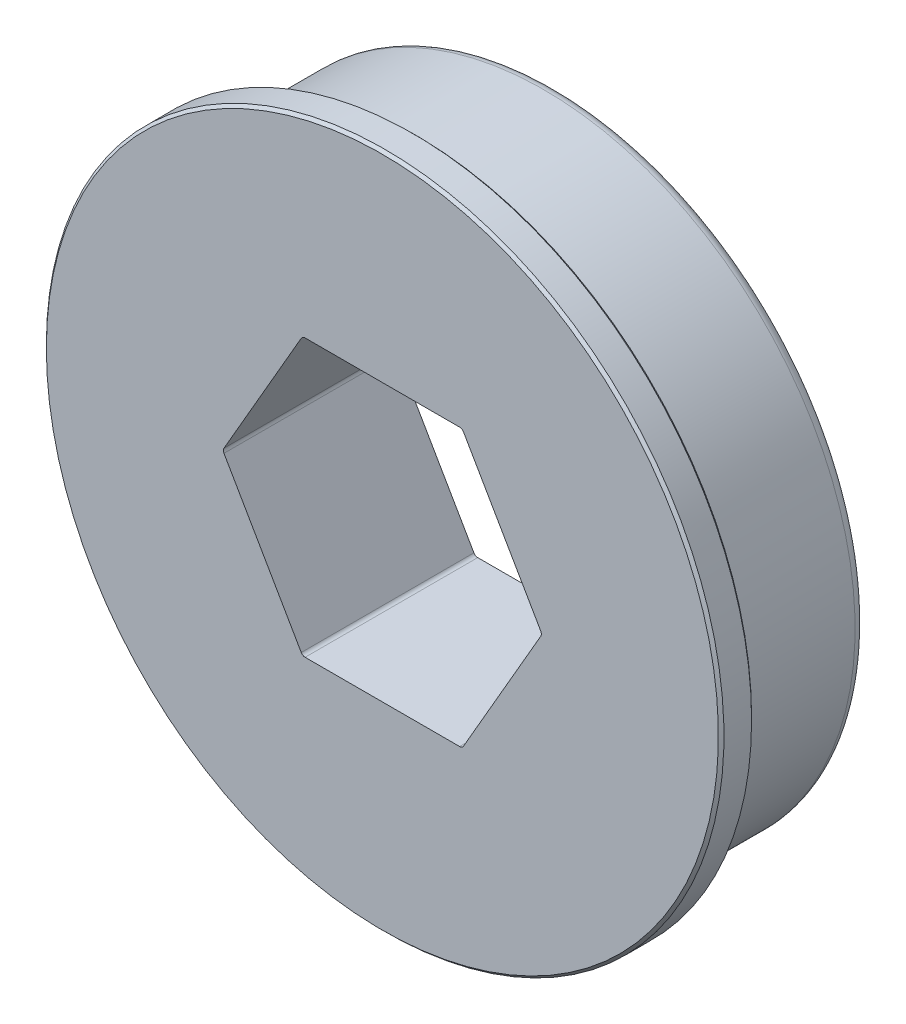
ISO-10303-21;
HEADER;
FILE_DESCRIPTION(('STEP AP214'),'2;1');
FILE_NAME('part.step','',(''),(''),'','','');
FILE_SCHEMA(('AUTOMOTIVE_DESIGN { 1 0 10303 214 1 1 1 1 }'));
ENDSEC;
DATA;
#1=APPLICATION_CONTEXT('core data for automotive mechanical design processes');
#2=APPLICATION_PROTOCOL_DEFINITION('international standard','automotive_design',2000,#1);
#3=PRODUCT_CONTEXT('',#1,'mechanical');
#4=PRODUCT('Part','Part','',(#3));
#5=PRODUCT_RELATED_PRODUCT_CATEGORY('part','',(#4));
#6=PRODUCT_DEFINITION_FORMATION('','',#4);
#7=PRODUCT_DEFINITION_CONTEXT('part definition',#1,'design');
#8=PRODUCT_DEFINITION('design','',#6,#7);
#9=PRODUCT_DEFINITION_SHAPE('','',#8);
#10=(LENGTH_UNIT() NAMED_UNIT(*) SI_UNIT(.MILLI.,.METRE.));
#11=(NAMED_UNIT(*) PLANE_ANGLE_UNIT() SI_UNIT($,.RADIAN.));
#12=(NAMED_UNIT(*) SI_UNIT($,.STERADIAN.) SOLID_ANGLE_UNIT());
#13=UNCERTAINTY_MEASURE_WITH_UNIT(LENGTH_MEASURE(1.E-05),#10,'distance_accuracy_value','');
#14=(GEOMETRIC_REPRESENTATION_CONTEXT(3) GLOBAL_UNCERTAINTY_ASSIGNED_CONTEXT((#13)) GLOBAL_UNIT_ASSIGNED_CONTEXT((#10,
#11,#12)) REPRESENTATION_CONTEXT('',''));
#15=CARTESIAN_POINT('',(0.,0.,0.));
#16=DIRECTION('',(0.,0.,1.));
#17=DIRECTION('',(1.,0.,0.));
#18=AXIS2_PLACEMENT_3D('',#15,#16,#17);
#19=CARTESIAN_POINT('',(0.,0.,7.92734));
#20=DIRECTION('',(0.,0.,-1.));
#21=DIRECTION('',(-1.,0.,0.));
#22=AXIS2_PLACEMENT_3D('',#19,#20,#21);
#23=CYLINDRICAL_SURFACE('',#22,13.97);
#24=CARTESIAN_POINT('',(0.,0.,6.40333999999999));
#25=DIRECTION('',(0.,0.,-1.));
#26=DIRECTION('',(-1.,0.,0.));
#27=AXIS2_PLACEMENT_3D('',#24,#25,#26);
#28=CIRCLE('',#27,13.97);
#29=CARTESIAN_POINT('',(-13.97,0.,6.40333999999999));
#30=VERTEX_POINT('',#29);
#31=EDGE_CURVE('E255',#30,#30,#28,.F.);
#32=ORIENTED_EDGE('',*,*,#31,.F.);
#33=EDGE_LOOP('',(#32));
#34=FACE_BOUND('',#33,.T.);
#35=CARTESIAN_POINT('',(0.,0.,5.89534));
#36=DIRECTION('',(0.,0.,-1.));
#37=DIRECTION('',(-1.,0.,0.));
#38=AXIS2_PLACEMENT_3D('',#35,#36,#37);
#39=CIRCLE('',#38,13.97);
#40=CARTESIAN_POINT('',(-13.97,0.,5.89534));
#41=VERTEX_POINT('',#40);
#42=EDGE_CURVE('E258',#41,#41,#39,.T.);
#43=ORIENTED_EDGE('',*,*,#42,.F.);
#44=EDGE_LOOP('',(#43));
#45=FACE_BOUND('',#44,.T.);
#46=ADVANCED_FACE('F17',(#34,#45),#23,.T.);
#47=CARTESIAN_POINT('',(14.2875,0.,5.89534));
#48=DIRECTION('',(0.,0.,1.));
#49=DIRECTION('',(1.,0.,0.));
#50=AXIS2_PLACEMENT_3D('',#47,#48,#49);
#51=PLANE('',#50);
#52=CARTESIAN_POINT('',(0.,0.,5.89534));
#53=DIRECTION('',(0.,0.,-1.));
#54=DIRECTION('',(-1.,0.,0.));
#55=AXIS2_PLACEMENT_3D('',#52,#53,#54);
#56=CIRCLE('',#55,14.2875);
#57=CARTESIAN_POINT('',(-14.2875,0.,5.89534));
#58=VERTEX_POINT('',#57);
#59=EDGE_CURVE('E252',#58,#58,#56,.T.);
#60=ORIENTED_EDGE('',*,*,#59,.F.);
#61=EDGE_LOOP('',(#60));
#62=FACE_BOUND('',#61,.T.);
#63=ORIENTED_EDGE('',*,*,#42,.T.);
#64=EDGE_LOOP('',(#63));
#65=FACE_BOUND('',#64,.T.);
#66=ADVANCED_FACE('F375',(#62,#65),#51,.T.);
#67=CARTESIAN_POINT('',(13.97,0.,6.40334));
#68=DIRECTION('',(0.,0.,-1.));
#69=DIRECTION('',(-1.,0.,0.));
#70=AXIS2_PLACEMENT_3D('',#67,#68,#69);
#71=PLANE('',#70);
#72=ORIENTED_EDGE('',*,*,#31,.T.);
#73=EDGE_LOOP('',(#72));
#74=FACE_BOUND('',#73,.T.);
#75=CARTESIAN_POINT('',(0.,0.,6.40334));
#76=DIRECTION('',(0.,0.,1.));
#77=DIRECTION('',(1.,0.,0.));
#78=AXIS2_PLACEMENT_3D('',#75,#76,#77);
#79=CIRCLE('',#78,15.4305);
#80=CARTESIAN_POINT('',(15.4305,0.,6.40334));
#81=VERTEX_POINT('',#80);
#82=EDGE_CURVE('E223',#81,#81,#79,.T.);
#83=ORIENTED_EDGE('',*,*,#82,.F.);
#84=EDGE_LOOP('',(#83));
#85=FACE_BOUND('',#84,.T.);
#86=ADVANCED_FACE('F373',(#74,#85),#71,.T.);
#87=CARTESIAN_POINT('',(0.,0.,7.92734));
#88=DIRECTION('',(0.,0.,-1.));
#89=DIRECTION('',(-1.,0.,0.));
#90=AXIS2_PLACEMENT_3D('',#87,#88,#89);
#91=CYLINDRICAL_SURFACE('',#90,14.2875);
#92=ORIENTED_EDGE('',*,*,#59,.T.);
#93=EDGE_LOOP('',(#92));
#94=FACE_BOUND('',#93,.T.);
#95=CARTESIAN_POINT('',(0.,0.,0.508));
#96=DIRECTION('',(0.,0.,-1.));
#97=DIRECTION('',(-1.,0.,0.));
#98=AXIS2_PLACEMENT_3D('',#95,#96,#97);
#99=CIRCLE('',#98,14.2875);
#100=CARTESIAN_POINT('',(-14.2875,0.,0.508));
#101=VERTEX_POINT('',#100);
#102=EDGE_CURVE('E220',#101,#101,#99,.T.);
#103=ORIENTED_EDGE('',*,*,#102,.F.);
#104=EDGE_LOOP('',(#103));
#105=FACE_BOUND('',#104,.T.);
#106=ADVANCED_FACE('F370',(#94,#105),#91,.T.);
#107=CARTESIAN_POINT('',(0.,0.,6.53034000000001));
#108=DIRECTION('',(0.,0.,1.));
#109=DIRECTION('',(1.,0.,0.));
#110=AXIS2_PLACEMENT_3D('',#107,#108,#109);
#111=CONICAL_SURFACE('',#110,15.5575,0.785398163397465);
#112=CARTESIAN_POINT('',(0.,0.,6.53034000000001));
#113=DIRECTION('',(0.,0.,-1.));
#114=DIRECTION('',(-1.,0.,0.));
#115=AXIS2_PLACEMENT_3D('',#112,#113,#114);
#116=CIRCLE('',#115,15.5575);
#117=CARTESIAN_POINT('',(-15.5575,0.,6.53034000000001));
#118=VERTEX_POINT('',#117);
#119=EDGE_CURVE('E84',#118,#118,#116,.F.);
#120=ORIENTED_EDGE('',*,*,#119,.F.);
#121=EDGE_LOOP('',(#120));
#122=FACE_BOUND('',#121,.T.);
#123=ORIENTED_EDGE('',*,*,#82,.T.);
#124=EDGE_LOOP('',(#123));
#125=FACE_BOUND('',#124,.T.);
#126=ADVANCED_FACE('F205',(#122,#125),#111,.T.);
#127=CARTESIAN_POINT('',(0.,0.,0.508));
#128=DIRECTION('',(0.,0.,-1.));
#129=DIRECTION('',(-1.,0.,0.));
#130=AXIS2_PLACEMENT_3D('',#127,#128,#129);
#131=TOROIDAL_SURFACE('',#130,13.7795,0.508);
#132=ORIENTED_EDGE('',*,*,#102,.T.);
#133=EDGE_LOOP('',(#132));
#134=FACE_BOUND('',#133,.T.);
#135=CARTESIAN_POINT('',(0.,0.,0.));
#136=DIRECTION('',(0.,0.,1.));
#137=DIRECTION('',(-1.,0.,0.));
#138=AXIS2_PLACEMENT_3D('',#135,#136,#137);
#139=CIRCLE('',#138,13.7795);
#140=CARTESIAN_POINT('',(13.7795,0.,0.));
#141=VERTEX_POINT('',#140);
#142=CARTESIAN_POINT('',(-13.7795,0.,0.));
#143=VERTEX_POINT('',#142);
#144=EDGE_CURVE('E243',#141,#143,#139,.F.);
#145=ORIENTED_EDGE('',*,*,#144,.F.);
#146=CARTESIAN_POINT('',(0.,0.,0.));
#147=DIRECTION('',(0.,0.,1.));
#148=DIRECTION('',(1.,0.,0.));
#149=AXIS2_PLACEMENT_3D('',#146,#147,#148);
#150=CIRCLE('',#149,13.7795);
#151=EDGE_CURVE('E153',#143,#141,#150,.F.);
#152=ORIENTED_EDGE('',*,*,#151,.F.);
#153=EDGE_LOOP('',(#145,#152));
#154=FACE_BOUND('',#153,.T.);
#155=ADVANCED_FACE('F199',(#134,#154),#131,.T.);
#156=CARTESIAN_POINT('',(0.,0.,7.92734));
#157=DIRECTION('',(0.,0.,-1.));
#158=DIRECTION('',(-1.,0.,0.));
#159=AXIS2_PLACEMENT_3D('',#156,#157,#158);
#160=CYLINDRICAL_SURFACE('',#159,15.5575);
#161=ORIENTED_EDGE('',*,*,#119,.T.);
#162=EDGE_LOOP('',(#161));
#163=FACE_BOUND('',#162,.T.);
#164=CARTESIAN_POINT('',(0.,0.,7.80034));
#165=DIRECTION('',(0.,0.,-1.));
#166=DIRECTION('',(-1.,0.,0.));
#167=AXIS2_PLACEMENT_3D('',#164,#165,#166);
#168=CIRCLE('',#167,15.5575);
#169=CARTESIAN_POINT('',(-15.5575,0.,7.80034));
#170=VERTEX_POINT('',#169);
#171=EDGE_CURVE('E144',#170,#170,#168,.F.);
#172=ORIENTED_EDGE('',*,*,#171,.F.);
#173=EDGE_LOOP('',(#172));
#174=FACE_BOUND('',#173,.T.);
#175=ADVANCED_FACE('F204',(#163,#174),#160,.T.);
#176=CARTESIAN_POINT('',(-7.09771326930958,0.,7.92734));
#177=DIRECTION('',(0.,0.,1.));
#178=DIRECTION('',(1.,0.,0.));
#179=AXIS2_PLACEMENT_3D('',#176,#177,#178);
#180=CYLINDRICAL_SURFACE('',#179,0.2032);
#181=DIRECTION('',(0.,0.,1.));
#182=VECTOR('',#181,1.);
#183=CARTESIAN_POINT('',(-7.27368963135858,-0.101600000000005,7.92734));
#184=LINE('',#183,#182);
#185=CARTESIAN_POINT('',(-7.27368963135857,-0.101600000000006,7.92734));
#186=VERTEX_POINT('',#185);
#187=CARTESIAN_POINT('',(-7.27368963135857,-0.101600000000005,0.));
#188=VERTEX_POINT('',#187);
#189=EDGE_CURVE('E142',#186,#188,#184,.F.);
#190=ORIENTED_EDGE('',*,*,#189,.T.);
#191=CARTESIAN_POINT('',(-7.09771326930958,0.,0.));
#192=DIRECTION('',(0.,0.,1.));
#193=DIRECTION('',(1.,0.,0.));
#194=AXIS2_PLACEMENT_3D('',#191,#192,#193);
#195=CIRCLE('',#194,0.2032);
#196=CARTESIAN_POINT('',(-7.27368963135857,0.101599999999994,0.));
#197=VERTEX_POINT('',#196);
#198=EDGE_CURVE('E92',#197,#188,#195,.T.);
#199=ORIENTED_EDGE('',*,*,#198,.F.);
#200=DIRECTION('',(0.,0.,1.));
#201=VECTOR('',#200,1.);
#202=CARTESIAN_POINT('',(-7.27368963135857,0.101599999999993,7.92734));
#203=LINE('',#202,#201);
#204=CARTESIAN_POINT('',(-7.27368963135857,0.101599999999994,7.92734));
#205=VERTEX_POINT('',#204);
#206=EDGE_CURVE('E88',#197,#205,#203,.T.);
#207=ORIENTED_EDGE('',*,*,#206,.T.);
#208=CARTESIAN_POINT('',(-7.09771326930958,0.,7.92734));
#209=DIRECTION('',(0.,0.,1.));
#210=DIRECTION('',(1.,0.,0.));
#211=AXIS2_PLACEMENT_3D('',#208,#209,#210);
#212=CIRCLE('',#211,0.2032);
#213=EDGE_CURVE('E72',#186,#205,#212,.F.);
#214=ORIENTED_EDGE('',*,*,#213,.F.);
#215=EDGE_LOOP('',(#190,#199,#207,#214));
#216=FACE_BOUND('',#215,.T.);
#217=ADVANCED_FACE('F89',(#216),#180,.F.);
#218=CARTESIAN_POINT('',(-3.54885663465479,6.14679999999999,7.92734));
#219=DIRECTION('',(0.,0.,1.));
#220=DIRECTION('',(1.,0.,0.));
#221=AXIS2_PLACEMENT_3D('',#218,#219,#220);
#222=CYLINDRICAL_SURFACE('',#221,0.2032);
#223=DIRECTION('',(0.,0.,1.));
#224=VECTOR('',#223,1.);
#225=CARTESIAN_POINT('',(-3.72483299670379,6.24839999999999,7.92734));
#226=LINE('',#225,#224);
#227=CARTESIAN_POINT('',(-3.72483299670379,6.24839999999999,7.92734));
#228=VERTEX_POINT('',#227);
#229=CARTESIAN_POINT('',(-3.72483299670378,6.24839999999999,0.));
#230=VERTEX_POINT('',#229);
#231=EDGE_CURVE('E102',#228,#230,#226,.F.);
#232=ORIENTED_EDGE('',*,*,#231,.T.);
#233=CARTESIAN_POINT('',(-3.54885663465479,6.14679999999999,0.));
#234=DIRECTION('',(0.,0.,1.));
#235=DIRECTION('',(1.,0.,0.));
#236=AXIS2_PLACEMENT_3D('',#233,#234,#235);
#237=CIRCLE('',#236,0.2032);
#238=CARTESIAN_POINT('',(-3.54885663465479,6.34999999999999,0.));
#239=VERTEX_POINT('',#238);
#240=EDGE_CURVE('E230',#239,#230,#237,.T.);
#241=ORIENTED_EDGE('',*,*,#240,.F.);
#242=DIRECTION('',(0.,0.,1.));
#243=VECTOR('',#242,1.);
#244=CARTESIAN_POINT('',(-3.54885663465479,6.34999999999999,7.92734));
#245=LINE('',#244,#243);
#246=CARTESIAN_POINT('',(-3.54885663465479,6.34999999999999,7.92734));
#247=VERTEX_POINT('',#246);
#248=EDGE_CURVE('E96',#239,#247,#245,.T.);
#249=ORIENTED_EDGE('',*,*,#248,.T.);
#250=CARTESIAN_POINT('',(-3.54885663465479,6.14679999999999,7.92734));
#251=DIRECTION('',(0.,0.,1.));
#252=DIRECTION('',(1.,0.,0.));
#253=AXIS2_PLACEMENT_3D('',#250,#251,#252);
#254=CIRCLE('',#253,0.2032);
#255=EDGE_CURVE('E83',#228,#247,#254,.F.);
#256=ORIENTED_EDGE('',*,*,#255,.F.);
#257=EDGE_LOOP('',(#232,#241,#249,#256));
#258=FACE_BOUND('',#257,.T.);
#259=ADVANCED_FACE('F320',(#258),#222,.F.);
#260=CARTESIAN_POINT('',(3.5488566346548,6.1468,7.92734));
#261=DIRECTION('',(0.,0.,1.));
#262=DIRECTION('',(1.,0.,0.));
#263=AXIS2_PLACEMENT_3D('',#260,#261,#262);
#264=CYLINDRICAL_SURFACE('',#263,0.2032);
#265=DIRECTION('',(0.,0.,1.));
#266=VECTOR('',#265,1.);
#267=CARTESIAN_POINT('',(3.5488566346548,6.35,7.92734));
#268=LINE('',#267,#266);
#269=CARTESIAN_POINT('',(3.5488566346548,6.34999999999999,7.92734));
#270=VERTEX_POINT('',#269);
#271=CARTESIAN_POINT('',(3.5488566346548,6.35,0.));
#272=VERTEX_POINT('',#271);
#273=EDGE_CURVE('E135',#270,#272,#268,.F.);
#274=ORIENTED_EDGE('',*,*,#273,.T.);
#275=CARTESIAN_POINT('',(3.5488566346548,6.1468,0.));
#276=DIRECTION('',(0.,0.,1.));
#277=DIRECTION('',(1.,0.,0.));
#278=AXIS2_PLACEMENT_3D('',#275,#276,#277);
#279=CIRCLE('',#278,0.2032);
#280=CARTESIAN_POINT('',(3.7248329967038,6.2484,0.));
#281=VERTEX_POINT('',#280);
#282=EDGE_CURVE('E233',#281,#272,#279,.T.);
#283=ORIENTED_EDGE('',*,*,#282,.F.);
#284=DIRECTION('',(0.,0.,1.));
#285=VECTOR('',#284,1.);
#286=CARTESIAN_POINT('',(3.72483299670379,6.2484,7.92734));
#287=LINE('',#286,#285);
#288=CARTESIAN_POINT('',(3.72483299670379,6.2484,7.92734));
#289=VERTEX_POINT('',#288);
#290=EDGE_CURVE('E125',#281,#289,#287,.T.);
#291=ORIENTED_EDGE('',*,*,#290,.T.);
#292=CARTESIAN_POINT('',(3.5488566346548,6.1468,7.92734));
#293=DIRECTION('',(0.,0.,1.));
#294=DIRECTION('',(1.,0.,0.));
#295=AXIS2_PLACEMENT_3D('',#292,#293,#294);
#296=CIRCLE('',#295,0.2032);
#297=EDGE_CURVE('E247',#270,#289,#296,.F.);
#298=ORIENTED_EDGE('',*,*,#297,.F.);
#299=EDGE_LOOP('',(#274,#283,#291,#298));
#300=FACE_BOUND('',#299,.T.);
#301=ADVANCED_FACE('F326',(#300),#264,.F.);
#302=CARTESIAN_POINT('',(7.09771326930959,0.,7.92734));
#303=DIRECTION('',(0.,0.,1.));
#304=DIRECTION('',(1.,0.,0.));
#305=AXIS2_PLACEMENT_3D('',#302,#303,#304);
#306=CYLINDRICAL_SURFACE('',#305,0.2032);
#307=CARTESIAN_POINT('',(7.09771326930959,0.,0.));
#308=DIRECTION('',(0.,0.,1.));
#309=DIRECTION('',(1.,0.,0.));
#310=AXIS2_PLACEMENT_3D('',#307,#308,#309);
#311=CIRCLE('',#310,0.2032);
#312=CARTESIAN_POINT('',(7.27368963135859,-0.101600000000005,0.));
#313=VERTEX_POINT('',#312);
#314=CARTESIAN_POINT('',(7.27368963135859,0.101599999999995,0.));
#315=VERTEX_POINT('',#314);
#316=EDGE_CURVE('E236',#313,#315,#311,.T.);
#317=ORIENTED_EDGE('',*,*,#316,.F.);
#318=DIRECTION('',(0.,0.,1.));
#319=VECTOR('',#318,1.);
#320=CARTESIAN_POINT('',(7.27368963135859,-0.101600000000005,7.92734));
#321=LINE('',#320,#319);
#322=CARTESIAN_POINT('',(7.27368963135859,-0.101600000000005,7.92734));
#323=VERTEX_POINT('',#322);
#324=EDGE_CURVE('E118',#313,#323,#321,.T.);
#325=ORIENTED_EDGE('',*,*,#324,.T.);
#326=CARTESIAN_POINT('',(7.09771326930959,0.,7.92734));
#327=DIRECTION('',(0.,0.,1.));
#328=DIRECTION('',(1.,0.,0.));
#329=AXIS2_PLACEMENT_3D('',#326,#327,#328);
#330=CIRCLE('',#329,0.2032);
#331=CARTESIAN_POINT('',(7.27368963135859,0.101599999999995,7.92734));
#332=VERTEX_POINT('',#331);
#333=EDGE_CURVE('E245',#332,#323,#330,.F.);
#334=ORIENTED_EDGE('',*,*,#333,.F.);
#335=DIRECTION('',(0.,0.,1.));
#336=VECTOR('',#335,1.);
#337=CARTESIAN_POINT('',(7.27368963135859,0.101599999999995,7.92734));
#338=LINE('',#337,#336);
#339=EDGE_CURVE('E129',#332,#315,#338,.F.);
#340=ORIENTED_EDGE('',*,*,#339,.T.);
#341=EDGE_LOOP('',(#317,#325,#334,#340));
#342=FACE_BOUND('',#341,.T.);
#343=ADVANCED_FACE('F307',(#342),#306,.F.);
#344=CARTESIAN_POINT('',(-3.54885663465478,-6.14680000000001,7.92734));
#345=DIRECTION('',(0.,0.,1.));
#346=DIRECTION('',(1.,0.,0.));
#347=AXIS2_PLACEMENT_3D('',#344,#345,#346);
#348=CYLINDRICAL_SURFACE('',#347,0.2032);
#349=DIRECTION('',(0.,0.,-1.));
#350=VECTOR('',#349,1.);
#351=CARTESIAN_POINT('',(-3.54885663465478,-6.35000000000001,7.92734));
#352=LINE('',#351,#350);
#353=CARTESIAN_POINT('',(-3.54885663465478,-6.35000000000001,7.92734));
#354=VERTEX_POINT('',#353);
#355=CARTESIAN_POINT('',(-3.54885663465478,-6.35000000000001,0.));
#356=VERTEX_POINT('',#355);
#357=EDGE_CURVE('E116',#354,#356,#352,.T.);
#358=ORIENTED_EDGE('',*,*,#357,.T.);
#359=CARTESIAN_POINT('',(-3.54885663465478,-6.14680000000001,0.));
#360=DIRECTION('',(0.,0.,1.));
#361=DIRECTION('',(1.,0.,0.));
#362=AXIS2_PLACEMENT_3D('',#359,#360,#361);
#363=CIRCLE('',#362,0.2032);
#364=CARTESIAN_POINT('',(-3.72483299670378,-6.24840000000001,0.));
#365=VERTEX_POINT('',#364);
#366=EDGE_CURVE('E239',#365,#356,#363,.T.);
#367=ORIENTED_EDGE('',*,*,#366,.F.);
#368=DIRECTION('',(0.,0.,1.));
#369=VECTOR('',#368,1.);
#370=CARTESIAN_POINT('',(-3.72483299670378,-6.24840000000001,7.92734));
#371=LINE('',#370,#369);
#372=CARTESIAN_POINT('',(-3.72483299670378,-6.24840000000001,7.92734));
#373=VERTEX_POINT('',#372);
#374=EDGE_CURVE('E139',#365,#373,#371,.T.);
#375=ORIENTED_EDGE('',*,*,#374,.T.);
#376=CARTESIAN_POINT('',(-3.54885663465478,-6.14680000000001,7.92734));
#377=DIRECTION('',(0.,0.,1.));
#378=DIRECTION('',(1.,0.,0.));
#379=AXIS2_PLACEMENT_3D('',#376,#377,#378);
#380=CIRCLE('',#379,0.2032);
#381=EDGE_CURVE('E37',#354,#373,#380,.F.);
#382=ORIENTED_EDGE('',*,*,#381,.F.);
#383=EDGE_LOOP('',(#358,#367,#375,#382));
#384=FACE_BOUND('',#383,.T.);
#385=ADVANCED_FACE('F170',(#384),#348,.F.);
#386=CARTESIAN_POINT('',(0.,0.,0.));
#387=DIRECTION('',(0.,0.,-1.));
#388=DIRECTION('',(-1.,0.,0.));
#389=AXIS2_PLACEMENT_3D('',#386,#387,#388);
#390=PLANE('',#389);
#391=DIRECTION('',(-1.,0.,0.));
#392=VECTOR('',#391,1.);
#393=CARTESIAN_POINT('',(-3.66617420935412,6.34999999999999,0.));
#394=LINE('',#393,#392);
#395=EDGE_CURVE('E132',#272,#239,#394,.T.);
#396=ORIENTED_EDGE('',*,*,#395,.T.);
#397=ORIENTED_EDGE('',*,*,#240,.T.);
#398=DIRECTION('',(-0.5,-0.866025403784439,0.));
#399=VECTOR('',#398,1.);
#400=CARTESIAN_POINT('',(-7.33234841870824,0.,0.));
#401=LINE('',#400,#399);
#402=EDGE_CURVE('E97',#230,#197,#401,.T.);
#403=ORIENTED_EDGE('',*,*,#402,.T.);
#404=ORIENTED_EDGE('',*,*,#198,.T.);
#405=DIRECTION('',(0.5,-0.866025403784439,0.));
#406=VECTOR('',#405,1.);
#407=CARTESIAN_POINT('',(-3.66617420935411,-6.35000000000001,0.));
#408=LINE('',#407,#406);
#409=EDGE_CURVE('E141',#188,#365,#408,.T.);
#410=ORIENTED_EDGE('',*,*,#409,.T.);
#411=ORIENTED_EDGE('',*,*,#366,.T.);
#412=DIRECTION('',(1.,0.,0.));
#413=VECTOR('',#412,1.);
#414=CARTESIAN_POINT('',(3.66617420935413,-6.35000000000001,0.));
#415=LINE('',#414,#413);
#416=CARTESIAN_POINT('',(3.5488566346548,-6.35000000000001,0.));
#417=VERTEX_POINT('',#416);
#418=EDGE_CURVE('E115',#356,#417,#415,.T.);
#419=ORIENTED_EDGE('',*,*,#418,.T.);
#420=CARTESIAN_POINT('',(3.5488566346548,-6.14680000000001,0.));
#421=DIRECTION('',(0.,0.,1.));
#422=DIRECTION('',(1.,0.,0.));
#423=AXIS2_PLACEMENT_3D('',#420,#421,#422);
#424=CIRCLE('',#423,0.2032);
#425=CARTESIAN_POINT('',(3.7248329967038,-6.24840000000001,0.));
#426=VERTEX_POINT('',#425);
#427=EDGE_CURVE('E227',#417,#426,#424,.T.);
#428=ORIENTED_EDGE('',*,*,#427,.T.);
#429=DIRECTION('',(0.5,0.866025403784439,0.));
#430=VECTOR('',#429,1.);
#431=CARTESIAN_POINT('',(7.33234841870825,0.,0.));
#432=LINE('',#431,#430);
#433=EDGE_CURVE('E121',#426,#313,#432,.T.);
#434=ORIENTED_EDGE('',*,*,#433,.T.);
#435=ORIENTED_EDGE('',*,*,#316,.T.);
#436=DIRECTION('',(-0.5,0.866025403784439,0.));
#437=VECTOR('',#436,1.);
#438=CARTESIAN_POINT('',(3.66617420935413,6.35,0.));
#439=LINE('',#438,#437);
#440=EDGE_CURVE('E128',#315,#281,#439,.T.);
#441=ORIENTED_EDGE('',*,*,#440,.T.);
#442=ORIENTED_EDGE('',*,*,#282,.T.);
#443=EDGE_LOOP('',(#396,#397,#403,#404,#410,#411,#419,#428,#434,#435,#441,#442));
#444=FACE_BOUND('',#443,.T.);
#445=ORIENTED_EDGE('',*,*,#151,.T.);
#446=ORIENTED_EDGE('',*,*,#144,.T.);
#447=EDGE_LOOP('',(#445,#446));
#448=FACE_BOUND('',#447,.T.);
#449=ADVANCED_FACE('F159',(#444,#448),#390,.T.);
#450=CARTESIAN_POINT('',(3.5488566346548,-6.14680000000001,7.92734));
#451=DIRECTION('',(0.,0.,1.));
#452=DIRECTION('',(1.,0.,0.));
#453=AXIS2_PLACEMENT_3D('',#450,#451,#452);
#454=CYLINDRICAL_SURFACE('',#453,0.2032);
#455=DIRECTION('',(0.,0.,1.));
#456=VECTOR('',#455,1.);
#457=CARTESIAN_POINT('',(3.7248329967038,-6.2484,7.92734));
#458=LINE('',#457,#456);
#459=CARTESIAN_POINT('',(3.7248329967038,-6.2484,7.92734));
#460=VERTEX_POINT('',#459);
#461=EDGE_CURVE('E122',#460,#426,#458,.F.);
#462=ORIENTED_EDGE('',*,*,#461,.T.);
#463=ORIENTED_EDGE('',*,*,#427,.F.);
#464=DIRECTION('',(0.,0.,-1.));
#465=VECTOR('',#464,1.);
#466=CARTESIAN_POINT('',(3.5488566346548,-6.35000000000001,7.92734));
#467=LINE('',#466,#465);
#468=CARTESIAN_POINT('',(3.5488566346548,-6.35000000000001,7.92734));
#469=VERTEX_POINT('',#468);
#470=EDGE_CURVE('E112',#417,#469,#467,.F.);
#471=ORIENTED_EDGE('',*,*,#470,.T.);
#472=CARTESIAN_POINT('',(3.5488566346548,-6.14680000000001,7.92734));
#473=DIRECTION('',(0.,0.,1.));
#474=DIRECTION('',(1.,0.,0.));
#475=AXIS2_PLACEMENT_3D('',#472,#473,#474);
#476=CIRCLE('',#475,0.2032);
#477=EDGE_CURVE('E194',#460,#469,#476,.F.);
#478=ORIENTED_EDGE('',*,*,#477,.F.);
#479=EDGE_LOOP('',(#462,#463,#471,#478));
#480=FACE_BOUND('',#479,.T.);
#481=ADVANCED_FACE('F169',(#480),#454,.F.);
#482=CARTESIAN_POINT('',(0.,0.,7.80034));
#483=DIRECTION('',(0.,0.,-1.));
#484=DIRECTION('',(-1.,0.,0.));
#485=AXIS2_PLACEMENT_3D('',#482,#483,#484);
#486=CONICAL_SURFACE('',#485,15.5575,0.785398163397442);
#487=ORIENTED_EDGE('',*,*,#171,.T.);
#488=EDGE_LOOP('',(#487));
#489=FACE_BOUND('',#488,.T.);
#490=CARTESIAN_POINT('',(0.,0.,7.92734));
#491=DIRECTION('',(0.,0.,-1.));
#492=DIRECTION('',(-1.,0.,0.));
#493=AXIS2_PLACEMENT_3D('',#490,#491,#492);
#494=CIRCLE('',#493,15.4305);
#495=CARTESIAN_POINT('',(-15.4305,0.,7.92734));
#496=VERTEX_POINT('',#495);
#497=EDGE_CURVE('E108',#496,#496,#494,.F.);
#498=ORIENTED_EDGE('',*,*,#497,.F.);
#499=EDGE_LOOP('',(#498));
#500=FACE_BOUND('',#499,.T.);
#501=ADVANCED_FACE('F351',(#489,#500),#486,.T.);
#502=CARTESIAN_POINT('',(-3.66617420935411,-6.35000000000001,7.92734));
#503=DIRECTION('',(-0.866025403784439,-0.5,0.));
#504=DIRECTION('',(0.5,-0.866025403784439,0.));
#505=AXIS2_PLACEMENT_3D('',#502,#503,#504);
#506=PLANE('',#505);
#507=ORIENTED_EDGE('',*,*,#374,.F.);
#508=ORIENTED_EDGE('',*,*,#409,.F.);
#509=ORIENTED_EDGE('',*,*,#189,.F.);
#510=DIRECTION('',(-0.5,0.866025403784438,0.));
#511=VECTOR('',#510,1.);
#512=CARTESIAN_POINT('',(-3.72483299670378,-6.24840000000001,7.92734));
#513=LINE('',#512,#511);
#514=EDGE_CURVE('E82',#373,#186,#513,.T.);
#515=ORIENTED_EDGE('',*,*,#514,.F.);
#516=EDGE_LOOP('',(#507,#508,#509,#515));
#517=FACE_BOUND('',#516,.T.);
#518=ADVANCED_FACE('F316',(#517),#506,.F.);
#519=CARTESIAN_POINT('',(-7.33234841870824,0.,7.92734));
#520=DIRECTION('',(-0.866025403784439,0.5,0.));
#521=DIRECTION('',(-0.5,-0.866025403784439,0.));
#522=AXIS2_PLACEMENT_3D('',#519,#520,#521);
#523=PLANE('',#522);
#524=ORIENTED_EDGE('',*,*,#206,.F.);
#525=ORIENTED_EDGE('',*,*,#402,.F.);
#526=ORIENTED_EDGE('',*,*,#231,.F.);
#527=DIRECTION('',(0.5,0.866025403784439,0.));
#528=VECTOR('',#527,1.);
#529=CARTESIAN_POINT('',(-7.27368963135857,0.101599999999993,7.92734));
#530=LINE('',#529,#528);
#531=EDGE_CURVE('E80',#205,#228,#530,.T.);
#532=ORIENTED_EDGE('',*,*,#531,.F.);
#533=EDGE_LOOP('',(#524,#525,#526,#532));
#534=FACE_BOUND('',#533,.T.);
#535=ADVANCED_FACE('F100',(#534),#523,.F.);
#536=CARTESIAN_POINT('',(-3.66617420935412,6.34999999999999,7.92734));
#537=DIRECTION('',(0.,1.,0.));
#538=DIRECTION('',(-1.,0.,0.));
#539=AXIS2_PLACEMENT_3D('',#536,#537,#538);
#540=PLANE('',#539);
#541=ORIENTED_EDGE('',*,*,#273,.F.);
#542=DIRECTION('',(1.,0.,0.));
#543=VECTOR('',#542,1.);
#544=CARTESIAN_POINT('',(15.5575,6.34999999999999,7.92734));
#545=LINE('',#544,#543);
#546=EDGE_CURVE('E103',#247,#270,#545,.T.);
#547=ORIENTED_EDGE('',*,*,#546,.F.);
#548=ORIENTED_EDGE('',*,*,#248,.F.);
#549=ORIENTED_EDGE('',*,*,#395,.F.);
#550=EDGE_LOOP('',(#541,#547,#548,#549));
#551=FACE_BOUND('',#550,.T.);
#552=ADVANCED_FACE('F324',(#551),#540,.F.);
#553=CARTESIAN_POINT('',(3.66617420935413,6.35,7.92734));
#554=DIRECTION('',(0.866025403784439,0.5,0.));
#555=DIRECTION('',(-0.5,0.866025403784439,0.));
#556=AXIS2_PLACEMENT_3D('',#553,#554,#555);
#557=PLANE('',#556);
#558=ORIENTED_EDGE('',*,*,#290,.F.);
#559=ORIENTED_EDGE('',*,*,#440,.F.);
#560=ORIENTED_EDGE('',*,*,#339,.F.);
#561=DIRECTION('',(0.5,-0.866025403784438,0.));
#562=VECTOR('',#561,1.);
#563=CARTESIAN_POINT('',(3.72483299670379,6.2484,7.92734));
#564=LINE('',#563,#562);
#565=EDGE_CURVE('E106',#289,#332,#564,.T.);
#566=ORIENTED_EDGE('',*,*,#565,.F.);
#567=EDGE_LOOP('',(#558,#559,#560,#566));
#568=FACE_BOUND('',#567,.T.);
#569=ADVANCED_FACE('F313',(#568),#557,.F.);
#570=CARTESIAN_POINT('',(7.33234841870825,0.,7.92734));
#571=DIRECTION('',(0.866025403784439,-0.5,0.));
#572=DIRECTION('',(0.5,0.866025403784439,0.));
#573=AXIS2_PLACEMENT_3D('',#570,#571,#572);
#574=PLANE('',#573);
#575=ORIENTED_EDGE('',*,*,#324,.F.);
#576=ORIENTED_EDGE('',*,*,#433,.F.);
#577=ORIENTED_EDGE('',*,*,#461,.F.);
#578=DIRECTION('',(-0.5,-0.866025403784439,0.));
#579=VECTOR('',#578,1.);
#580=CARTESIAN_POINT('',(7.27368963135859,-0.101600000000005,7.92734));
#581=LINE('',#580,#579);
#582=EDGE_CURVE('E28',#323,#460,#581,.T.);
#583=ORIENTED_EDGE('',*,*,#582,.F.);
#584=EDGE_LOOP('',(#575,#576,#577,#583));
#585=FACE_BOUND('',#584,.T.);
#586=ADVANCED_FACE('F304',(#585),#574,.F.);
#587=CARTESIAN_POINT('',(3.66617420935413,-6.35000000000001,7.92734));
#588=DIRECTION('',(0.,-1.,0.));
#589=DIRECTION('',(0.,0.,-1.));
#590=AXIS2_PLACEMENT_3D('',#587,#588,#589);
#591=PLANE('',#590);
#592=ORIENTED_EDGE('',*,*,#470,.F.);
#593=ORIENTED_EDGE('',*,*,#418,.F.);
#594=ORIENTED_EDGE('',*,*,#357,.F.);
#595=DIRECTION('',(1.,0.,0.));
#596=VECTOR('',#595,1.);
#597=CARTESIAN_POINT('',(15.5575,-6.35000000000001,7.92734));
#598=LINE('',#597,#596);
#599=EDGE_CURVE('E11',#469,#354,#598,.F.);
#600=ORIENTED_EDGE('',*,*,#599,.F.);
#601=EDGE_LOOP('',(#592,#593,#594,#600));
#602=FACE_BOUND('',#601,.T.);
#603=ADVANCED_FACE('F296',(#602),#591,.F.);
#604=CARTESIAN_POINT('',(15.5575,0.,7.92734));
#605=DIRECTION('',(0.,0.,1.));
#606=DIRECTION('',(1.,0.,0.));
#607=AXIS2_PLACEMENT_3D('',#604,#605,#606);
#608=PLANE('',#607);
#609=ORIENTED_EDGE('',*,*,#599,.T.);
#610=ORIENTED_EDGE('',*,*,#381,.T.);
#611=ORIENTED_EDGE('',*,*,#514,.T.);
#612=ORIENTED_EDGE('',*,*,#213,.T.);
#613=ORIENTED_EDGE('',*,*,#531,.T.);
#614=ORIENTED_EDGE('',*,*,#255,.T.);
#615=ORIENTED_EDGE('',*,*,#546,.T.);
#616=ORIENTED_EDGE('',*,*,#297,.T.);
#617=ORIENTED_EDGE('',*,*,#565,.T.);
#618=ORIENTED_EDGE('',*,*,#333,.T.);
#619=ORIENTED_EDGE('',*,*,#582,.T.);
#620=ORIENTED_EDGE('',*,*,#477,.T.);
#621=EDGE_LOOP('',(#609,#610,#611,#612,#613,#614,#615,#616,#617,#618,#619,#620));
#622=FACE_BOUND('',#621,.T.);
#623=ORIENTED_EDGE('',*,*,#497,.T.);
#624=EDGE_LOOP('',(#623));
#625=FACE_BOUND('',#624,.T.);
#626=ADVANCED_FACE('F77',(#622,#625),#608,.T.);
#627=CLOSED_SHELL('',(#46,#66,#86,#106,#126,#155,#175,#217,#259,#301,#343,#385,#449,#481,#501,
#518,#535,#552,#569,#586,#603,#626));
#628=MANIFOLD_SOLID_BREP('B1',#627);
#629=ADVANCED_BREP_SHAPE_REPRESENTATION('',(#18,#628),#14);
#630=SHAPE_DEFINITION_REPRESENTATION(#9,#629);
ENDSEC;
END-ISO-10303-21;
